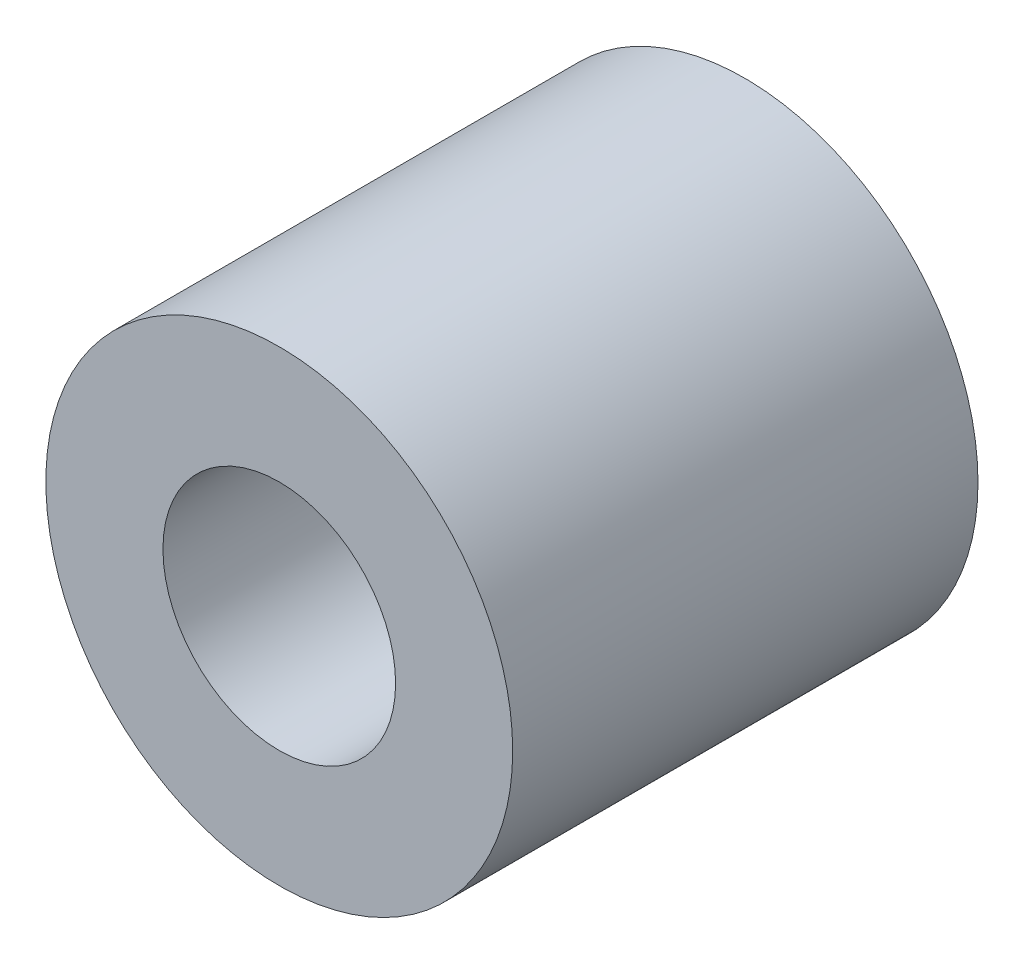
ISO-10303-21;
HEADER;
FILE_DESCRIPTION(('STEP AP214'),'2;1');
FILE_NAME('part.step','',(''),(''),'','','');
FILE_SCHEMA(('AUTOMOTIVE_DESIGN { 1 0 10303 214 1 1 1 1 }'));
ENDSEC;
DATA;
#1=APPLICATION_CONTEXT('core data for automotive mechanical design processes');
#2=APPLICATION_PROTOCOL_DEFINITION('international standard','automotive_design',2000,#1);
#3=PRODUCT_CONTEXT('',#1,'mechanical');
#4=PRODUCT('Part','Part','',(#3));
#5=PRODUCT_RELATED_PRODUCT_CATEGORY('part','',(#4));
#6=PRODUCT_DEFINITION_FORMATION('','',#4);
#7=PRODUCT_DEFINITION_CONTEXT('part definition',#1,'design');
#8=PRODUCT_DEFINITION('design','',#6,#7);
#9=PRODUCT_DEFINITION_SHAPE('','',#8);
#10=(LENGTH_UNIT() NAMED_UNIT(*) SI_UNIT(.MILLI.,.METRE.));
#11=(NAMED_UNIT(*) PLANE_ANGLE_UNIT() SI_UNIT($,.RADIAN.));
#12=(NAMED_UNIT(*) SI_UNIT($,.STERADIAN.) SOLID_ANGLE_UNIT());
#13=UNCERTAINTY_MEASURE_WITH_UNIT(LENGTH_MEASURE(1.E-05),#10,'distance_accuracy_value','');
#14=(GEOMETRIC_REPRESENTATION_CONTEXT(3) GLOBAL_UNCERTAINTY_ASSIGNED_CONTEXT((#13)) GLOBAL_UNIT_ASSIGNED_CONTEXT((#10,
#11,#12)) REPRESENTATION_CONTEXT('',''));
#15=CARTESIAN_POINT('',(0.,0.,0.));
#16=DIRECTION('',(0.,0.,1.));
#17=DIRECTION('',(1.,0.,0.));
#18=AXIS2_PLACEMENT_3D('',#15,#16,#17);
#19=CARTESIAN_POINT('',(0.,0.,3.));
#20=DIRECTION('',(0.,0.,1.));
#21=DIRECTION('',(1.,0.,0.));
#22=AXIS2_PLACEMENT_3D('',#19,#20,#21);
#23=PLANE('',#22);
#24=CARTESIAN_POINT('',(0.,0.,3.));
#25=DIRECTION('',(0.,0.,1.));
#26=DIRECTION('',(1.,0.,0.));
#27=AXIS2_PLACEMENT_3D('',#24,#25,#26);
#28=CIRCLE('',#27,3.01);
#29=CARTESIAN_POINT('',(3.01,0.,3.));
#30=VERTEX_POINT('',#29);
#31=EDGE_CURVE('E10',#30,#30,#28,.T.);
#32=ORIENTED_EDGE('',*,*,#31,.T.);
#33=EDGE_LOOP('',(#32));
#34=FACE_BOUND('',#33,.T.);
#35=CARTESIAN_POINT('',(0.,0.,3.));
#36=DIRECTION('',(0.,0.,1.));
#37=DIRECTION('',(1.,0.,0.));
#38=AXIS2_PLACEMENT_3D('',#35,#36,#37);
#39=CIRCLE('',#38,1.5);
#40=CARTESIAN_POINT('',(1.5,0.,3.));
#41=VERTEX_POINT('',#40);
#42=EDGE_CURVE('E45',#41,#41,#39,.T.);
#43=ORIENTED_EDGE('',*,*,#42,.F.);
#44=EDGE_LOOP('',(#43));
#45=FACE_BOUND('',#44,.T.);
#46=ADVANCED_FACE('F34',(#34,#45),#23,.T.);
#47=CARTESIAN_POINT('',(0.,0.,-3.));
#48=DIRECTION('',(0.,0.,1.));
#49=DIRECTION('',(1.,0.,0.));
#50=AXIS2_PLACEMENT_3D('',#47,#48,#49);
#51=PLANE('',#50);
#52=CARTESIAN_POINT('',(0.,0.,-3.));
#53=DIRECTION('',(0.,0.,1.));
#54=DIRECTION('',(1.,0.,0.));
#55=AXIS2_PLACEMENT_3D('',#52,#53,#54);
#56=CIRCLE('',#55,3.01);
#57=CARTESIAN_POINT('',(3.01,0.,-3.));
#58=VERTEX_POINT('',#57);
#59=EDGE_CURVE('E38',#58,#58,#56,.T.);
#60=ORIENTED_EDGE('',*,*,#59,.F.);
#61=EDGE_LOOP('',(#60));
#62=FACE_BOUND('',#61,.T.);
#63=CARTESIAN_POINT('',(0.,0.,-3.));
#64=DIRECTION('',(0.,0.,1.));
#65=DIRECTION('',(1.,0.,0.));
#66=AXIS2_PLACEMENT_3D('',#63,#64,#65);
#67=CIRCLE('',#66,1.5);
#68=CARTESIAN_POINT('',(1.5,0.,-3.));
#69=VERTEX_POINT('',#68);
#70=EDGE_CURVE('E47',#69,#69,#67,.T.);
#71=ORIENTED_EDGE('',*,*,#70,.T.);
#72=EDGE_LOOP('',(#71));
#73=FACE_BOUND('',#72,.T.);
#74=ADVANCED_FACE('F57',(#62,#73),#51,.F.);
#75=CARTESIAN_POINT('',(0.,0.,3.));
#76=DIRECTION('',(0.,0.,-1.));
#77=DIRECTION('',(-1.,0.,0.));
#78=AXIS2_PLACEMENT_3D('',#75,#76,#77);
#79=CYLINDRICAL_SURFACE('',#78,3.01);
#80=ORIENTED_EDGE('',*,*,#31,.F.);
#81=EDGE_LOOP('',(#80));
#82=FACE_BOUND('',#81,.T.);
#83=ORIENTED_EDGE('',*,*,#59,.T.);
#84=EDGE_LOOP('',(#83));
#85=FACE_BOUND('',#84,.T.);
#86=ADVANCED_FACE('F36',(#82,#85),#79,.T.);
#87=CARTESIAN_POINT('',(0.,0.,3.));
#88=DIRECTION('',(0.,0.,-1.));
#89=DIRECTION('',(-1.,0.,0.));
#90=AXIS2_PLACEMENT_3D('',#87,#88,#89);
#91=CYLINDRICAL_SURFACE('',#90,1.5);
#92=ORIENTED_EDGE('',*,*,#42,.T.);
#93=EDGE_LOOP('',(#92));
#94=FACE_BOUND('',#93,.T.);
#95=ORIENTED_EDGE('',*,*,#70,.F.);
#96=EDGE_LOOP('',(#95));
#97=FACE_BOUND('',#96,.T.);
#98=ADVANCED_FACE('F53',(#94,#97),#91,.F.);
#99=CLOSED_SHELL('',(#46,#74,#86,#98));
#100=MANIFOLD_SOLID_BREP('B2',#99);
#101=ADVANCED_BREP_SHAPE_REPRESENTATION('',(#18,#100),#14);
#102=SHAPE_DEFINITION_REPRESENTATION(#9,#101);
ENDSEC;
END-ISO-10303-21;
